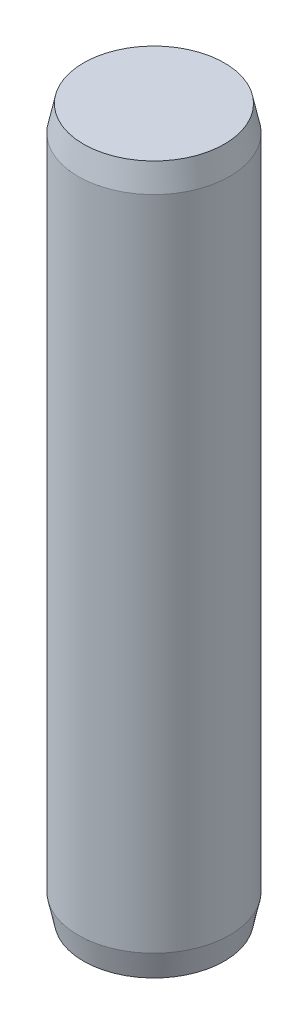
ISO-10303-21;
HEADER;
FILE_DESCRIPTION(('STEP AP214'),'2;1');
FILE_NAME('part.step','',(''),(''),'','','');
FILE_SCHEMA(('AUTOMOTIVE_DESIGN { 1 0 10303 214 1 1 1 1 }'));
ENDSEC;
DATA;
#1=APPLICATION_CONTEXT('core data for automotive mechanical design processes');
#2=APPLICATION_PROTOCOL_DEFINITION('international standard','automotive_design',2000,#1);
#3=PRODUCT_CONTEXT('',#1,'mechanical');
#4=PRODUCT('Part','Part','',(#3));
#5=PRODUCT_RELATED_PRODUCT_CATEGORY('part','',(#4));
#6=PRODUCT_DEFINITION_FORMATION('','',#4);
#7=PRODUCT_DEFINITION_CONTEXT('part definition',#1,'design');
#8=PRODUCT_DEFINITION('design','',#6,#7);
#9=PRODUCT_DEFINITION_SHAPE('','',#8);
#10=(LENGTH_UNIT() NAMED_UNIT(*) SI_UNIT(.MILLI.,.METRE.));
#11=(NAMED_UNIT(*) PLANE_ANGLE_UNIT() SI_UNIT($,.RADIAN.));
#12=(NAMED_UNIT(*) SI_UNIT($,.STERADIAN.) SOLID_ANGLE_UNIT());
#13=UNCERTAINTY_MEASURE_WITH_UNIT(LENGTH_MEASURE(1.E-05),#10,'distance_accuracy_value','');
#14=(GEOMETRIC_REPRESENTATION_CONTEXT(3) GLOBAL_UNCERTAINTY_ASSIGNED_CONTEXT((#13)) GLOBAL_UNIT_ASSIGNED_CONTEXT((#10,
#11,#12)) REPRESENTATION_CONTEXT('',''));
#15=CARTESIAN_POINT('',(0.,0.,0.));
#16=DIRECTION('',(0.,0.,1.));
#17=DIRECTION('',(1.,0.,0.));
#18=AXIS2_PLACEMENT_3D('',#15,#16,#17);
#19=CARTESIAN_POINT('',(0.,14.,0.));
#20=DIRECTION('',(0.,-1.,0.));
#21=DIRECTION('',(0.,0.,-1.));
#22=AXIS2_PLACEMENT_3D('',#19,#20,#21);
#23=CYLINDRICAL_SURFACE('',#22,1.5);
#24=CARTESIAN_POINT('',(0.,0.500000000000009,0.));
#25=DIRECTION('',(0.,1.,0.));
#26=DIRECTION('',(0.,0.,1.));
#27=AXIS2_PLACEMENT_3D('',#24,#25,#26);
#28=CIRCLE('',#27,1.5);
#29=CARTESIAN_POINT('',(0.,0.500000000000009,1.5));
#30=VERTEX_POINT('',#29);
#31=EDGE_CURVE('E41',#30,#30,#28,.T.);
#32=ORIENTED_EDGE('',*,*,#31,.T.);
#33=EDGE_LOOP('',(#32));
#34=FACE_BOUND('',#33,.T.);
#35=CARTESIAN_POINT('',(0.,13.5,0.));
#36=DIRECTION('',(0.,1.,0.));
#37=DIRECTION('',(0.,0.,1.));
#38=AXIS2_PLACEMENT_3D('',#35,#36,#37);
#39=CIRCLE('',#38,1.5);
#40=CARTESIAN_POINT('',(0.,13.5,1.5));
#41=VERTEX_POINT('',#40);
#42=EDGE_CURVE('E45',#41,#41,#39,.F.);
#43=ORIENTED_EDGE('',*,*,#42,.T.);
#44=EDGE_LOOP('',(#43));
#45=FACE_BOUND('',#44,.T.);
#46=ADVANCED_FACE('F34',(#34,#45),#23,.T.);
#47=CARTESIAN_POINT('',(0.,14.,0.));
#48=DIRECTION('',(0.,1.,0.));
#49=DIRECTION('',(0.,0.,1.));
#50=AXIS2_PLACEMENT_3D('',#47,#48,#49);
#51=PLANE('',#50);
#52=CARTESIAN_POINT('',(0.,14.,0.));
#53=DIRECTION('',(0.,1.,0.));
#54=DIRECTION('',(0.,0.,1.));
#55=AXIS2_PLACEMENT_3D('',#52,#53,#54);
#56=CIRCLE('',#55,1.39372171916499);
#57=CARTESIAN_POINT('',(0.,14.,1.39372171916499));
#58=VERTEX_POINT('',#57);
#59=EDGE_CURVE('E49',#58,#58,#56,.T.);
#60=ORIENTED_EDGE('',*,*,#59,.T.);
#61=EDGE_LOOP('',(#60));
#62=FACE_BOUND('',#61,.T.);
#63=ADVANCED_FACE('F55',(#62),#51,.T.);
#64=CARTESIAN_POINT('',(0.,0.,0.));
#65=DIRECTION('',(0.,1.,0.));
#66=DIRECTION('',(0.,0.,1.));
#67=AXIS2_PLACEMENT_3D('',#64,#65,#66);
#68=PLANE('',#67);
#69=CARTESIAN_POINT('',(0.,0.,0.));
#70=DIRECTION('',(0.,1.,0.));
#71=DIRECTION('',(0.,0.,1.));
#72=AXIS2_PLACEMENT_3D('',#69,#70,#71);
#73=CIRCLE('',#72,1.39372171916499);
#74=CARTESIAN_POINT('',(0.,0.,1.39372171916499));
#75=VERTEX_POINT('',#74);
#76=EDGE_CURVE('E10',#75,#75,#73,.F.);
#77=ORIENTED_EDGE('',*,*,#76,.T.);
#78=EDGE_LOOP('',(#77));
#79=FACE_BOUND('',#78,.T.);
#80=ADVANCED_FACE('F59',(#79),#68,.F.);
#81=CARTESIAN_POINT('',(0.,14.,0.));
#82=DIRECTION('',(0.,-1.,0.));
#83=DIRECTION('',(0.,0.,-1.));
#84=AXIS2_PLACEMENT_3D('',#81,#82,#83);
#85=CONICAL_SURFACE('',#84,1.39372171916499,0.209439510239315);
#86=ORIENTED_EDGE('',*,*,#42,.F.);
#87=EDGE_LOOP('',(#86));
#88=FACE_BOUND('',#87,.T.);
#89=ORIENTED_EDGE('',*,*,#59,.F.);
#90=EDGE_LOOP('',(#89));
#91=FACE_BOUND('',#90,.T.);
#92=ADVANCED_FACE('F57',(#88,#91),#85,.T.);
#93=CARTESIAN_POINT('',(0.,0.500000000000009,0.));
#94=DIRECTION('',(0.,1.,0.));
#95=DIRECTION('',(0.,0.,1.));
#96=AXIS2_PLACEMENT_3D('',#93,#94,#95);
#97=CONICAL_SURFACE('',#96,1.5,0.209439510239316);
#98=ORIENTED_EDGE('',*,*,#76,.F.);
#99=EDGE_LOOP('',(#98));
#100=FACE_BOUND('',#99,.T.);
#101=ORIENTED_EDGE('',*,*,#31,.F.);
#102=EDGE_LOOP('',(#101));
#103=FACE_BOUND('',#102,.T.);
#104=ADVANCED_FACE('F36',(#100,#103),#97,.T.);
#105=CLOSED_SHELL('',(#46,#63,#80,#92,#104));
#106=MANIFOLD_SOLID_BREP('B2',#105);
#107=ADVANCED_BREP_SHAPE_REPRESENTATION('',(#18,#106),#14);
#108=SHAPE_DEFINITION_REPRESENTATION(#9,#107);
ENDSEC;
END-ISO-10303-21;
